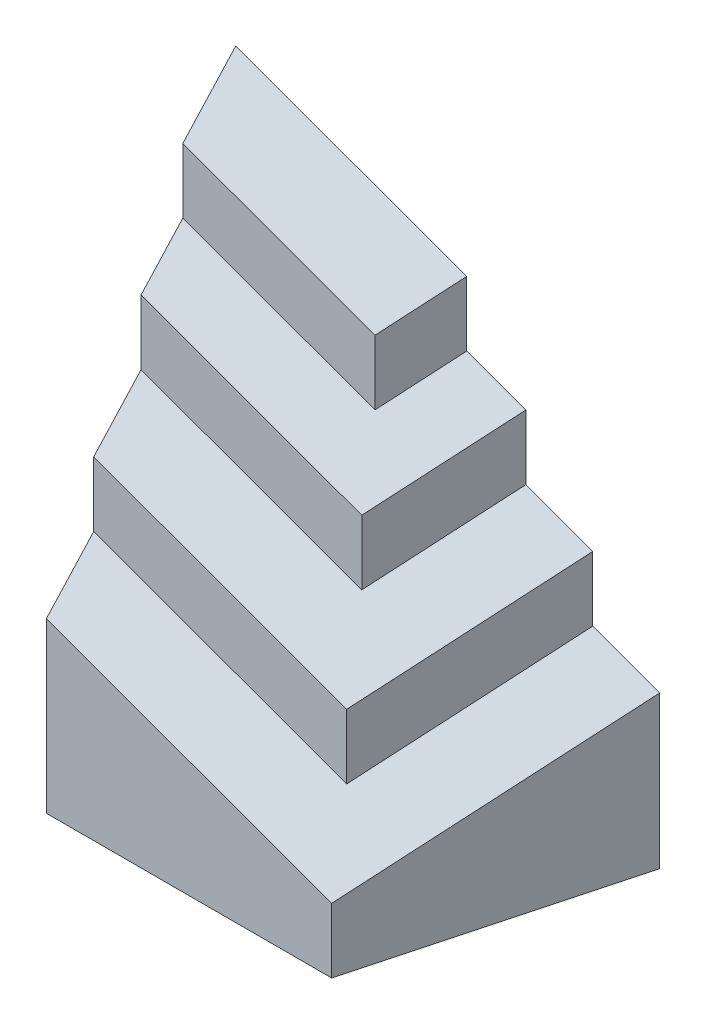
ISO-10303-21;
HEADER;
FILE_DESCRIPTION(('STEP AP214'),'2;1');
FILE_NAME('part.step','',(''),(''),'','','');
FILE_SCHEMA(('AUTOMOTIVE_DESIGN { 1 0 10303 214 1 1 1 1 }'));
ENDSEC;
DATA;
#1=APPLICATION_CONTEXT('core data for automotive mechanical design processes');
#2=APPLICATION_PROTOCOL_DEFINITION('international standard','automotive_design',2000,#1);
#3=PRODUCT_CONTEXT('',#1,'mechanical');
#4=PRODUCT('Part','Part','',(#3));
#5=PRODUCT_RELATED_PRODUCT_CATEGORY('part','',(#4));
#6=PRODUCT_DEFINITION_FORMATION('','',#4);
#7=PRODUCT_DEFINITION_CONTEXT('part definition',#1,'design');
#8=PRODUCT_DEFINITION('design','',#6,#7);
#9=PRODUCT_DEFINITION_SHAPE('','',#8);
#10=(LENGTH_UNIT() NAMED_UNIT(*) SI_UNIT(.MILLI.,.METRE.));
#11=(NAMED_UNIT(*) PLANE_ANGLE_UNIT() SI_UNIT($,.RADIAN.));
#12=(NAMED_UNIT(*) SI_UNIT($,.STERADIAN.) SOLID_ANGLE_UNIT());
#13=UNCERTAINTY_MEASURE_WITH_UNIT(LENGTH_MEASURE(1.E-05),#10,'distance_accuracy_value','');
#14=(GEOMETRIC_REPRESENTATION_CONTEXT(3) GLOBAL_UNCERTAINTY_ASSIGNED_CONTEXT((#13)) GLOBAL_UNIT_ASSIGNED_CONTEXT((#10,
#11,#12)) REPRESENTATION_CONTEXT('',''));
#15=CARTESIAN_POINT('',(0.,0.,0.));
#16=DIRECTION('',(0.,0.,1.));
#17=DIRECTION('',(1.,0.,0.));
#18=AXIS2_PLACEMENT_3D('',#15,#16,#17);
#19=CARTESIAN_POINT('',(-93.2205450853161,90.,-68.));
#20=DIRECTION('',(0.965925826289069,0.,-0.258819045102518));
#21=DIRECTION('',(-0.258819045102518,0.,-0.965925826289069));
#22=AXIS2_PLACEMENT_3D('',#19,#20,#21);
#23=PLANE('',#22);
#24=DIRECTION('',(0.230086960241302,-0.45793098012554,0.858696225779629));
#25=VECTOR('',#24,1.);
#26=CARTESIAN_POINT('',(-88.8414888196667,122.845815207864,-51.6571395273933));
#27=LINE('',#26,#25);
#28=CARTESIAN_POINT('',(-93.2205450853161,131.561239696286,-68.));
#29=VERTEX_POINT('',#28);
#30=CARTESIAN_POINT('',(-88.1295104291249,121.428798955108,-49.));
#31=VERTEX_POINT('',#30);
#32=EDGE_CURVE('E130',#29,#31,#27,.T.);
#33=ORIENTED_EDGE('',*,*,#32,.F.);
#34=DIRECTION('',(0.,-1.,0.));
#35=VECTOR('',#34,1.);
#36=CARTESIAN_POINT('',(-93.2205450853161,90.,-68.));
#37=LINE('',#36,#35);
#38=CARTESIAN_POINT('',(-93.2205450853161,0.,-68.));
#39=VERTEX_POINT('',#38);
#40=EDGE_CURVE('E137',#29,#39,#37,.T.);
#41=ORIENTED_EDGE('',*,*,#40,.T.);
#42=DIRECTION('',(0.258819045102518,0.,0.965925826289069));
#43=VECTOR('',#42,1.);
#44=CARTESIAN_POINT('',(-93.2205450853161,0.,-68.));
#45=LINE('',#44,#43);
#46=CARTESIAN_POINT('',(-75.,0.,0.));
#47=VERTEX_POINT('',#46);
#48=EDGE_CURVE('E153',#39,#47,#45,.T.);
#49=ORIENTED_EDGE('',*,*,#48,.T.);
#50=DIRECTION('',(0.,-1.,0.));
#51=VECTOR('',#50,1.);
#52=CARTESIAN_POINT('',(-75.,90.,0.));
#53=LINE('',#52,#51);
#54=CARTESIAN_POINT('',(-75.,44.2977675699652,0.));
#55=VERTEX_POINT('',#54);
#56=EDGE_CURVE('E148',#55,#47,#53,.T.);
#57=ORIENTED_EDGE('',*,*,#56,.F.);
#58=DIRECTION('',(0.230086960241302,-0.457930980125537,0.85869622577963));
#59=VECTOR('',#58,1.);
#60=CARTESIAN_POINT('',(-94.2150501277544,82.5405551183592,-71.711543346763));
#61=LINE('',#60,#59);
#62=CARTESIAN_POINT('',(-79.555136271329,53.3636356015454,-17.));
#63=VERTEX_POINT('',#62);
#64=EDGE_CURVE('E207',#63,#55,#61,.T.);
#65=ORIENTED_EDGE('',*,*,#64,.F.);
#66=DIRECTION('',(0.,-1.,0.));
#67=VECTOR('',#66,1.);
#68=CARTESIAN_POINT('',(-79.555136271329,100.,-17.));
#69=LINE('',#68,#67);
#70=CARTESIAN_POINT('',(-79.555136271329,70.3636356015455,-17.));
#71=VERTEX_POINT('',#70);
#72=EDGE_CURVE('E205',#71,#63,#69,.T.);
#73=ORIENTED_EDGE('',*,*,#72,.F.);
#74=DIRECTION('',(0.230086960241302,-0.457930980125538,0.85869622577963));
#75=VECTOR('',#74,1.);
#76=CARTESIAN_POINT('',(-92.4238630250585,95.9756418148608,-65.0267420736398));
#77=LINE('',#76,#75);
#78=CARTESIAN_POINT('',(-84.1102725426581,79.4295036331257,-34.));
#79=VERTEX_POINT('',#78);
#80=EDGE_CURVE('E196',#79,#71,#77,.T.);
#81=ORIENTED_EDGE('',*,*,#80,.F.);
#82=DIRECTION('',(0.,-1.,0.));
#83=VECTOR('',#82,1.);
#84=CARTESIAN_POINT('',(-84.1102725426581,120.,-34.));
#85=LINE('',#84,#83);
#86=CARTESIAN_POINT('',(-84.1102725426581,96.4295036331257,-34.));
#87=VERTEX_POINT('',#86);
#88=EDGE_CURVE('E190',#87,#79,#85,.T.);
#89=ORIENTED_EDGE('',*,*,#88,.F.);
#90=DIRECTION('',(0.230086960241302,-0.457930980125538,0.85869622577963));
#91=VECTOR('',#90,1.);
#92=CARTESIAN_POINT('',(-90.6326759223626,109.410728511362,-58.3419408005165));
#93=LINE('',#92,#91);
#94=CARTESIAN_POINT('',(-88.1295104291249,104.428798955108,-49.));
#95=VERTEX_POINT('',#94);
#96=EDGE_CURVE('E183',#95,#87,#93,.T.);
#97=ORIENTED_EDGE('',*,*,#96,.F.);
#98=DIRECTION('',(0.,-1.,0.));
#99=VECTOR('',#98,1.);
#100=CARTESIAN_POINT('',(-88.1295104291248,140.,-49.));
#101=LINE('',#100,#99);
#102=EDGE_CURVE('E140',#31,#95,#101,.T.);
#103=ORIENTED_EDGE('',*,*,#102,.F.);
#104=EDGE_LOOP('',(#33,#41,#49,#57,#65,#73,#81,#89,#97,#103));
#105=FACE_BOUND('',#104,.T.);
#106=ADVANCED_FACE('F30',(#105),#23,.F.);
#107=CARTESIAN_POINT('',(-37.5990224109692,140.,-49.));
#108=DIRECTION('',(0.,0.,-1.));
#109=DIRECTION('',(-1.,0.,0.));
#110=AXIS2_PLACEMENT_3D('',#107,#108,#109);
#111=PLANE('',#110);
#112=DIRECTION('',(0.939692620785908,-0.34202014332567,0.));
#113=VECTOR('',#112,1.);
#114=CARTESIAN_POINT('',(-49.478635607175,107.361030991569,-49.));
#115=LINE('',#114,#113);
#116=CARTESIAN_POINT('',(-37.5990224109692,103.037205393555,-49.));
#117=VERTEX_POINT('',#116);
#118=EDGE_CURVE('E141',#31,#117,#115,.T.);
#119=ORIENTED_EDGE('',*,*,#118,.F.);
#120=ORIENTED_EDGE('',*,*,#102,.T.);
#121=DIRECTION('',(-0.939692620785908,0.34202014332567,0.));
#122=VECTOR('',#121,1.);
#123=CARTESIAN_POINT('',(36.340511369109,59.1254159620855,-49.));
#124=LINE('',#123,#122);
#125=CARTESIAN_POINT('',(-37.5990224109692,86.0372053935545,-49.));
#126=VERTEX_POINT('',#125);
#127=EDGE_CURVE('E11',#126,#95,#124,.T.);
#128=ORIENTED_EDGE('',*,*,#127,.F.);
#129=DIRECTION('',(0.,-1.,0.));
#130=VECTOR('',#129,1.);
#131=CARTESIAN_POINT('',(-37.5990224109692,140.,-49.));
#132=LINE('',#131,#130);
#133=EDGE_CURVE('E45',#117,#126,#132,.T.);
#134=ORIENTED_EDGE('',*,*,#133,.F.);
#135=EDGE_LOOP('',(#119,#120,#128,#134));
#136=FACE_BOUND('',#135,.T.);
#137=ADVANCED_FACE('F174',(#136),#111,.F.);
#138=CARTESIAN_POINT('',(-32.5079877547779,140.,-68.));
#139=DIRECTION('',(-0.965925826289069,0.,-0.258819045102517));
#140=DIRECTION('',(-0.258819045102517,0.,0.965925826289069));
#141=AXIS2_PLACEMENT_3D('',#138,#139,#140);
#142=PLANE('',#141);
#143=DIRECTION('',(0.246021755934266,0.310556043191505,-0.918165692914006));
#144=VECTOR('',#143,1.);
#145=CARTESIAN_POINT('',(-30.1749044076983,112.408753460623,-76.7071855895942));
#146=LINE('',#145,#144);
#147=CARTESIAN_POINT('',(-32.5079877547779,109.46367598179,-68.));
#148=VERTEX_POINT('',#147);
#149=EDGE_CURVE('E132',#117,#148,#146,.T.);
#150=ORIENTED_EDGE('',*,*,#149,.F.);
#151=ORIENTED_EDGE('',*,*,#133,.T.);
#152=DIRECTION('',(-0.246021755934267,-0.310556043191503,0.918165692914006));
#153=VECTOR('',#152,1.);
#154=CARTESIAN_POINT('',(-24.7480877075492,102.259085518143,-96.9603412379142));
#155=LINE('',#154,#153);
#156=CARTESIAN_POINT('',(-32.5079877547779,92.4636759817899,-68.));
#157=VERTEX_POINT('',#156);
#158=EDGE_CURVE('E38',#157,#126,#155,.T.);
#159=ORIENTED_EDGE('',*,*,#158,.F.);
#160=DIRECTION('',(0.,-1.,0.));
#161=VECTOR('',#160,1.);
#162=CARTESIAN_POINT('',(-32.5079877547779,140.,-68.));
#163=LINE('',#162,#161);
#164=EDGE_CURVE('E53',#148,#157,#163,.T.);
#165=ORIENTED_EDGE('',*,*,#164,.F.);
#166=EDGE_LOOP('',(#150,#151,#159,#165));
#167=FACE_BOUND('',#166,.T.);
#168=ADVANCED_FACE('F278',(#167),#142,.F.);
#169=CARTESIAN_POINT('',(41.8794603102467,74.3435531053732,-88.5495618689642));
#170=DIRECTION('',(0.316512390639909,0.869610646260747,0.378942252172248));
#171=DIRECTION('',(0.,-0.399480176931693,0.916741832927146));
#172=AXIS2_PLACEMENT_3D('',#169,#170,#171);
#173=PLANE('',#172);
#174=ORIENTED_EDGE('',*,*,#158,.T.);
#175=ORIENTED_EDGE('',*,*,#127,.T.);
#176=ORIENTED_EDGE('',*,*,#96,.T.);
#177=DIRECTION('',(0.939692620785908,-0.34202014332567,0.));
#178=VECTOR('',#177,1.);
#179=CARTESIAN_POINT('',(-40.4517149094433,80.53908818364,-34.));
#180=LINE('',#179,#178);
#181=CARTESIAN_POINT('',(-26.0891175912847,75.3115302730786,-34.));
#182=VERTEX_POINT('',#181);
#183=EDGE_CURVE('E177',#87,#182,#180,.T.);
#184=ORIENTED_EDGE('',*,*,#183,.T.);
#185=DIRECTION('',(0.246021755934267,0.310556043191503,-0.918165692914006));
#186=VECTOR('',#185,1.);
#187=CARTESIAN_POINT('',(-14.4431283726849,90.01239409321,-77.4634234682145));
#188=LINE('',#187,#186);
#189=CARTESIAN_POINT('',(-16.9788450486267,86.8115302730787,-68.));
#190=VERTEX_POINT('',#189);
#191=EDGE_CURVE('E175',#182,#190,#188,.T.);
#192=ORIENTED_EDGE('',*,*,#191,.T.);
#193=DIRECTION('',(-0.939692620785908,0.34202014332567,0.));
#194=VECTOR('',#193,1.);
#195=CARTESIAN_POINT('',(-16.9788450486267,86.8115302730787,-68.));
#196=LINE('',#195,#194);
#197=EDGE_CURVE('E172',#190,#157,#196,.T.);
#198=ORIENTED_EDGE('',*,*,#197,.T.);
#199=EDGE_LOOP('',(#174,#175,#176,#184,#192,#198));
#200=FACE_BOUND('',#199,.T.);
#201=ADVANCED_FACE('F171',(#200),#173,.T.);
#202=CARTESIAN_POINT('',(-26.0891175912847,120.,-34.));
#203=DIRECTION('',(0.,0.,-1.));
#204=DIRECTION('',(-1.,0.,0.));
#205=AXIS2_PLACEMENT_3D('',#202,#203,#204);
#206=PLANE('',#205);
#207=ORIENTED_EDGE('',*,*,#183,.F.);
#208=ORIENTED_EDGE('',*,*,#88,.T.);
#209=DIRECTION('',(-0.939692620785908,0.34202014332567,0.));
#210=VECTOR('',#209,1.);
#211=CARTESIAN_POINT('',(24.5086136743471,39.8954621709882,-34.));
#212=LINE('',#211,#210);
#213=CARTESIAN_POINT('',(-26.0891175912847,58.3115302730787,-34.));
#214=VERTEX_POINT('',#213);
#215=EDGE_CURVE('E167',#214,#79,#212,.T.);
#216=ORIENTED_EDGE('',*,*,#215,.F.);
#217=DIRECTION('',(0.,-1.,0.));
#218=VECTOR('',#217,1.);
#219=CARTESIAN_POINT('',(-26.0891175912847,120.,-34.));
#220=LINE('',#219,#218);
#221=EDGE_CURVE('E188',#182,#214,#220,.T.);
#222=ORIENTED_EDGE('',*,*,#221,.F.);
#223=EDGE_LOOP('',(#207,#208,#216,#222));
#224=FACE_BOUND('',#223,.T.);
#225=ADVANCED_FACE('F259',(#224),#206,.F.);
#226=CARTESIAN_POINT('',(-16.9788450486267,120.,-68.));
#227=DIRECTION('',(-0.965925826289069,0.,-0.258819045102517));
#228=DIRECTION('',(-0.258819045102517,0.,0.965925826289069));
#229=AXIS2_PLACEMENT_3D('',#226,#227,#228);
#230=PLANE('',#229);
#231=ORIENTED_EDGE('',*,*,#191,.F.);
#232=ORIENTED_EDGE('',*,*,#221,.T.);
#233=DIRECTION('',(-0.246021755934267,-0.310556043191502,0.918165692914007));
#234=VECTOR('',#233,1.);
#235=CARTESIAN_POINT('',(-8.71325541611231,80.245277488525,-98.8476004630587));
#236=LINE('',#235,#234);
#237=CARTESIAN_POINT('',(-16.9788450486267,69.8115302730787,-68.));
#238=VERTEX_POINT('',#237);
#239=EDGE_CURVE('E164',#238,#214,#236,.T.);
#240=ORIENTED_EDGE('',*,*,#239,.F.);
#241=DIRECTION('',(0.,-1.,0.));
#242=VECTOR('',#241,1.);
#243=CARTESIAN_POINT('',(-16.9788450486267,120.,-68.));
#244=LINE('',#243,#242);
#245=EDGE_CURVE('E186',#190,#238,#244,.T.);
#246=ORIENTED_EDGE('',*,*,#245,.F.);
#247=EDGE_LOOP('',(#231,#232,#240,#246));
#248=FACE_BOUND('',#247,.T.);
#249=ADVANCED_FACE('F263',(#248),#230,.F.);
#250=CARTESIAN_POINT('',(32.8556594590213,62.8287819835347,-93.6001167716578));
#251=DIRECTION('',(0.316512390639909,0.869610646260747,0.378942252172248));
#252=DIRECTION('',(0.,-0.399480176931693,0.916741832927146));
#253=AXIS2_PLACEMENT_3D('',#250,#251,#252);
#254=PLANE('',#253);
#255=ORIENTED_EDGE('',*,*,#239,.T.);
#256=ORIENTED_EDGE('',*,*,#215,.T.);
#257=ORIENTED_EDGE('',*,*,#80,.T.);
#258=DIRECTION('',(0.939692620785908,-0.34202014332567,0.));
#259=VECTOR('',#258,1.);
#260=CARTESIAN_POINT('',(-30.3497623072847,52.4543441126961,-17.));
#261=LINE('',#260,#259);
#262=CARTESIAN_POINT('',(-13.0445587956424,46.1557651365393,-17.));
#263=VERTEX_POINT('',#262);
#264=EDGE_CURVE('E194',#71,#263,#261,.T.);
#265=ORIENTED_EDGE('',*,*,#264,.T.);
#266=DIRECTION('',(0.246021755934267,0.310556043191502,-0.918165692914007));
#267=VECTOR('',#266,1.);
#268=CARTESIAN_POINT('',(3.41677921755503,66.9350981658603,-78.4345498258184));
#269=LINE('',#268,#267);
#270=CARTESIAN_POINT('',(0.620850018344713,63.4057651365393,-68.));
#271=VERTEX_POINT('',#270);
#272=EDGE_CURVE('E192',#263,#271,#269,.T.);
#273=ORIENTED_EDGE('',*,*,#272,.T.);
#274=DIRECTION('',(-0.939692620785908,0.34202014332567,0.));
#275=VECTOR('',#274,1.);
#276=CARTESIAN_POINT('',(0.620850018344713,63.4057651365393,-68.));
#277=LINE('',#276,#275);
#278=EDGE_CURVE('E198',#271,#238,#277,.T.);
#279=ORIENTED_EDGE('',*,*,#278,.T.);
#280=EDGE_LOOP('',(#255,#256,#257,#265,#273,#279));
#281=FACE_BOUND('',#280,.T.);
#282=ADVANCED_FACE('F253',(#281),#254,.T.);
#283=CARTESIAN_POINT('',(-13.0445587956424,100.,-17.));
#284=DIRECTION('',(0.,0.,-1.));
#285=DIRECTION('',(-1.,0.,0.));
#286=AXIS2_PLACEMENT_3D('',#283,#284,#285);
#287=PLANE('',#286);
#288=ORIENTED_EDGE('',*,*,#264,.F.);
#289=ORIENTED_EDGE('',*,*,#72,.T.);
#290=DIRECTION('',(-0.939692620785908,0.342020143325669,0.));
#291=VECTOR('',#290,1.);
#292=CARTESIAN_POINT('',(43.2134859605522,8.67951140726866,-17.));
#293=LINE('',#292,#291);
#294=CARTESIAN_POINT('',(-13.0445587956424,29.1557651365393,-17.));
#295=VERTEX_POINT('',#294);
#296=EDGE_CURVE('E161',#295,#63,#293,.T.);
#297=ORIENTED_EDGE('',*,*,#296,.F.);
#298=DIRECTION('',(0.,-1.,0.));
#299=VECTOR('',#298,1.);
#300=CARTESIAN_POINT('',(-13.0445587956424,100.,-17.));
#301=LINE('',#300,#299);
#302=EDGE_CURVE('E203',#263,#295,#301,.T.);
#303=ORIENTED_EDGE('',*,*,#302,.F.);
#304=EDGE_LOOP('',(#288,#289,#297,#303));
#305=FACE_BOUND('',#304,.T.);
#306=ADVANCED_FACE('F251',(#305),#287,.F.);
#307=CARTESIAN_POINT('',(0.620850018344717,100.,-68.));
#308=DIRECTION('',(-0.965925826289069,0.,-0.258819045102518));
#309=DIRECTION('',(-0.258819045102518,0.,0.965925826289069));
#310=AXIS2_PLACEMENT_3D('',#307,#308,#309);
#311=PLANE('',#310);
#312=ORIENTED_EDGE('',*,*,#272,.F.);
#313=ORIENTED_EDGE('',*,*,#302,.T.);
#314=DIRECTION('',(-0.246021755934267,-0.310556043191502,0.918165692914007));
#315=VECTOR('',#314,1.);
#316=CARTESIAN_POINT('',(-16.2508547674451,25.1084214919799,-5.03394052912861));
#317=LINE('',#316,#315);
#318=CARTESIAN_POINT('',(0.620850018344712,46.4057651365393,-68.));
#319=VERTEX_POINT('',#318);
#320=EDGE_CURVE('E158',#319,#295,#317,.T.);
#321=ORIENTED_EDGE('',*,*,#320,.F.);
#322=DIRECTION('',(0.,-1.,0.));
#323=VECTOR('',#322,1.);
#324=CARTESIAN_POINT('',(0.620850018344717,100.,-68.));
#325=LINE('',#324,#323);
#326=EDGE_CURVE('E201',#271,#319,#325,.T.);
#327=ORIENTED_EDGE('',*,*,#326,.F.);
#328=EDGE_LOOP('',(#312,#313,#321,#327));
#329=FACE_BOUND('',#328,.T.);
#330=ADVANCED_FACE('F243',(#329),#311,.F.);
#331=CARTESIAN_POINT('',(40.533711030425,1.31689029752381,2.13430246789642));
#332=DIRECTION('',(0.316512390639909,0.869610646260747,0.378942252172248));
#333=DIRECTION('',(0.,-0.399480176931693,0.916741832927146));
#334=AXIS2_PLACEMENT_3D('',#331,#332,#333);
#335=PLANE('',#334);
#336=ORIENTED_EDGE('',*,*,#320,.T.);
#337=ORIENTED_EDGE('',*,*,#296,.T.);
#338=ORIENTED_EDGE('',*,*,#64,.T.);
#339=DIRECTION('',(0.939692620785908,-0.34202014332567,0.));
#340=VECTOR('',#339,1.);
#341=CARTESIAN_POINT('',(-89.6884143705204,49.6439131894026,0.));
#342=LINE('',#341,#340);
#343=CARTESIAN_POINT('',(0.,17.,0.));
#344=VERTEX_POINT('',#343);
#345=EDGE_CURVE('E209',#55,#344,#342,.T.);
#346=ORIENTED_EDGE('',*,*,#345,.T.);
#347=DIRECTION('',(0.246021755934267,0.310556043191502,-0.918165692914007));
#348=VECTOR('',#347,1.);
#349=CARTESIAN_POINT('',(5.57745864352392,24.0404890852816,-20.8153590347457));
#350=LINE('',#349,#348);
#351=CARTESIAN_POINT('',(18.2205450853161,40.,-68.));
#352=VERTEX_POINT('',#351);
#353=EDGE_CURVE('E211',#344,#352,#350,.T.);
#354=ORIENTED_EDGE('',*,*,#353,.T.);
#355=DIRECTION('',(-0.939692620785908,0.342020143325669,0.));
#356=VECTOR('',#355,1.);
#357=CARTESIAN_POINT('',(18.2205450853161,40.,-68.));
#358=LINE('',#357,#356);
#359=EDGE_CURVE('E213',#352,#319,#358,.T.);
#360=ORIENTED_EDGE('',*,*,#359,.T.);
#361=EDGE_LOOP('',(#336,#337,#338,#346,#354,#360));
#362=FACE_BOUND('',#361,.T.);
#363=ADVANCED_FACE('F237',(#362),#335,.T.);
#364=CARTESIAN_POINT('',(-75.,90.,0.));
#365=DIRECTION('',(0.,0.,-1.));
#366=DIRECTION('',(-1.,0.,0.));
#367=AXIS2_PLACEMENT_3D('',#364,#365,#366);
#368=PLANE('',#367);
#369=ORIENTED_EDGE('',*,*,#345,.F.);
#370=ORIENTED_EDGE('',*,*,#56,.T.);
#371=DIRECTION('',(1.,0.,0.));
#372=VECTOR('',#371,1.);
#373=CARTESIAN_POINT('',(-75.,0.,0.));
#374=LINE('',#373,#372);
#375=CARTESIAN_POINT('',(0.,0.,0.));
#376=VERTEX_POINT('',#375);
#377=EDGE_CURVE('E216',#47,#376,#374,.T.);
#378=ORIENTED_EDGE('',*,*,#377,.T.);
#379=DIRECTION('',(0.,-1.,0.));
#380=VECTOR('',#379,1.);
#381=CARTESIAN_POINT('',(0.,90.,0.));
#382=LINE('',#381,#380);
#383=EDGE_CURVE('E150',#344,#376,#382,.T.);
#384=ORIENTED_EDGE('',*,*,#383,.F.);
#385=EDGE_LOOP('',(#369,#370,#378,#384));
#386=FACE_BOUND('',#385,.T.);
#387=ADVANCED_FACE('F32',(#386),#368,.F.);
#388=CARTESIAN_POINT('',(0.,90.,0.));
#389=DIRECTION('',(-0.965925826289069,0.,-0.258819045102518));
#390=DIRECTION('',(-0.258819045102518,0.,0.965925826289069));
#391=AXIS2_PLACEMENT_3D('',#388,#389,#390);
#392=PLANE('',#391);
#393=ORIENTED_EDGE('',*,*,#353,.F.);
#394=ORIENTED_EDGE('',*,*,#383,.T.);
#395=DIRECTION('',(0.258819045102518,0.,-0.965925826289069));
#396=VECTOR('',#395,1.);
#397=CARTESIAN_POINT('',(0.,0.,0.));
#398=LINE('',#397,#396);
#399=CARTESIAN_POINT('',(18.2205450853161,0.,-68.));
#400=VERTEX_POINT('',#399);
#401=EDGE_CURVE('E219',#376,#400,#398,.T.);
#402=ORIENTED_EDGE('',*,*,#401,.T.);
#403=DIRECTION('',(0.,-1.,0.));
#404=VECTOR('',#403,1.);
#405=CARTESIAN_POINT('',(18.2205450853161,90.,-68.));
#406=LINE('',#405,#404);
#407=EDGE_CURVE('E147',#352,#400,#406,.T.);
#408=ORIENTED_EDGE('',*,*,#407,.F.);
#409=EDGE_LOOP('',(#393,#394,#402,#408));
#410=FACE_BOUND('',#409,.T.);
#411=ADVANCED_FACE('F234',(#410),#392,.F.);
#412=CARTESIAN_POINT('',(18.2205450853161,90.,-68.));
#413=DIRECTION('',(0.,0.,1.));
#414=DIRECTION('',(1.,0.,0.));
#415=AXIS2_PLACEMENT_3D('',#412,#413,#414);
#416=PLANE('',#415);
#417=ORIENTED_EDGE('',*,*,#40,.F.);
#418=DIRECTION('',(-0.939692620785908,0.34202014332567,0.));
#419=VECTOR('',#418,1.);
#420=CARTESIAN_POINT('',(-32.5079877547779,109.46367598179,-68.));
#421=LINE('',#420,#419);
#422=EDGE_CURVE('E127',#148,#29,#421,.T.);
#423=ORIENTED_EDGE('',*,*,#422,.F.);
#424=ORIENTED_EDGE('',*,*,#164,.T.);
#425=ORIENTED_EDGE('',*,*,#197,.F.);
#426=ORIENTED_EDGE('',*,*,#245,.T.);
#427=ORIENTED_EDGE('',*,*,#278,.F.);
#428=ORIENTED_EDGE('',*,*,#326,.T.);
#429=ORIENTED_EDGE('',*,*,#359,.F.);
#430=ORIENTED_EDGE('',*,*,#407,.T.);
#431=DIRECTION('',(-1.,0.,0.));
#432=VECTOR('',#431,1.);
#433=CARTESIAN_POINT('',(18.2205450853161,0.,-68.));
#434=LINE('',#433,#432);
#435=EDGE_CURVE('E145',#400,#39,#434,.T.);
#436=ORIENTED_EDGE('',*,*,#435,.T.);
#437=EDGE_LOOP('',(#417,#423,#424,#425,#426,#427,#428,#429,#430,#436));
#438=FACE_BOUND('',#437,.T.);
#439=ADVANCED_FACE('F143',(#438),#416,.F.);
#440=CARTESIAN_POINT('',(0.,0.,0.));
#441=DIRECTION('',(0.,1.,0.));
#442=DIRECTION('',(0.,0.,1.));
#443=AXIS2_PLACEMENT_3D('',#440,#441,#442);
#444=PLANE('',#443);
#445=ORIENTED_EDGE('',*,*,#377,.F.);
#446=ORIENTED_EDGE('',*,*,#48,.F.);
#447=ORIENTED_EDGE('',*,*,#435,.F.);
#448=ORIENTED_EDGE('',*,*,#401,.F.);
#449=EDGE_LOOP('',(#445,#446,#447,#448));
#450=FACE_BOUND('',#449,.T.);
#451=ADVANCED_FACE('F230',(#450),#444,.F.);
#452=CARTESIAN_POINT('',(-5.30871581391865,85.784145690872,-36.3775958339883));
#453=DIRECTION('',(0.316512390639909,0.869610646260746,0.37894225217225));
#454=DIRECTION('',(0.,-0.399480176931695,0.916741832927145));
#455=AXIS2_PLACEMENT_3D('',#452,#453,#454);
#456=PLANE('',#455);
#457=ORIENTED_EDGE('',*,*,#32,.T.);
#458=ORIENTED_EDGE('',*,*,#118,.T.);
#459=ORIENTED_EDGE('',*,*,#149,.T.);
#460=ORIENTED_EDGE('',*,*,#422,.T.);
#461=EDGE_LOOP('',(#457,#458,#459,#460));
#462=FACE_BOUND('',#461,.T.);
#463=ADVANCED_FACE('F129',(#462),#456,.T.);
#464=CLOSED_SHELL('',(#106,#137,#168,#201,#225,#249,#282,#306,#330,#363,#387,#411,#439,#451,#463));
#465=MANIFOLD_SOLID_BREP('B2',#464);
#466=ADVANCED_BREP_SHAPE_REPRESENTATION('',(#18,#465),#14);
#467=SHAPE_DEFINITION_REPRESENTATION(#9,#466);
ENDSEC;
END-ISO-10303-21;
